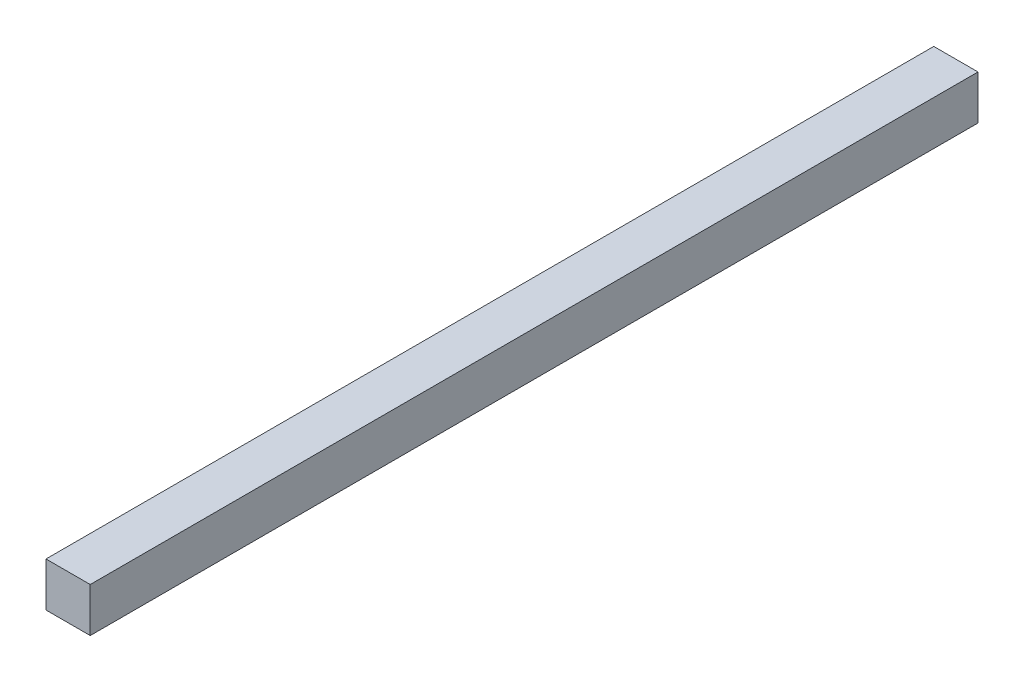
ISO-10303-21;
HEADER;
FILE_DESCRIPTION(('STEP AP214'),'2;1');
FILE_NAME('part.step','',(''),(''),'','','');
FILE_SCHEMA(('AUTOMOTIVE_DESIGN { 1 0 10303 214 1 1 1 1 }'));
ENDSEC;
DATA;
#1=APPLICATION_CONTEXT('core data for automotive mechanical design processes');
#2=APPLICATION_PROTOCOL_DEFINITION('international standard','automotive_design',2000,#1);
#3=PRODUCT_CONTEXT('',#1,'mechanical');
#4=PRODUCT('Part','Part','',(#3));
#5=PRODUCT_RELATED_PRODUCT_CATEGORY('part','',(#4));
#6=PRODUCT_DEFINITION_FORMATION('','',#4);
#7=PRODUCT_DEFINITION_CONTEXT('part definition',#1,'design');
#8=PRODUCT_DEFINITION('design','',#6,#7);
#9=PRODUCT_DEFINITION_SHAPE('','',#8);
#10=(LENGTH_UNIT() NAMED_UNIT(*) SI_UNIT(.MILLI.,.METRE.));
#11=(NAMED_UNIT(*) PLANE_ANGLE_UNIT() SI_UNIT($,.RADIAN.));
#12=(NAMED_UNIT(*) SI_UNIT($,.STERADIAN.) SOLID_ANGLE_UNIT());
#13=UNCERTAINTY_MEASURE_WITH_UNIT(LENGTH_MEASURE(1.E-05),#10,'distance_accuracy_value','');
#14=(GEOMETRIC_REPRESENTATION_CONTEXT(3) GLOBAL_UNCERTAINTY_ASSIGNED_CONTEXT((#13)) GLOBAL_UNIT_ASSIGNED_CONTEXT((#10,
#11,#12)) REPRESENTATION_CONTEXT('',''));
#15=CARTESIAN_POINT('',(0.,0.,0.));
#16=DIRECTION('',(0.,0.,1.));
#17=DIRECTION('',(1.,0.,0.));
#18=AXIS2_PLACEMENT_3D('',#15,#16,#17);
#19=CARTESIAN_POINT('',(-5.,5.,200.7));
#20=DIRECTION('',(1.,0.,0.));
#21=DIRECTION('',(0.,1.,0.));
#22=AXIS2_PLACEMENT_3D('',#19,#20,#21);
#23=PLANE('',#22);
#24=DIRECTION('',(0.,-1.,0.));
#25=VECTOR('',#24,1.);
#26=CARTESIAN_POINT('',(-5.,5.,0.));
#27=LINE('',#26,#25);
#28=CARTESIAN_POINT('',(-5.,5.,0.));
#29=VERTEX_POINT('',#28);
#30=CARTESIAN_POINT('',(-5.,-5.,0.));
#31=VERTEX_POINT('',#30);
#32=EDGE_CURVE('E95',#29,#31,#27,.T.);
#33=ORIENTED_EDGE('',*,*,#32,.T.);
#34=DIRECTION('',(0.,0.,-1.));
#35=VECTOR('',#34,1.);
#36=CARTESIAN_POINT('',(-5.,-5.,200.7));
#37=LINE('',#36,#35);
#38=CARTESIAN_POINT('',(-5.,-5.,200.7));
#39=VERTEX_POINT('',#38);
#40=EDGE_CURVE('E11',#39,#31,#37,.T.);
#41=ORIENTED_EDGE('',*,*,#40,.F.);
#42=DIRECTION('',(0.,-1.,0.));
#43=VECTOR('',#42,1.);
#44=CARTESIAN_POINT('',(-5.,5.,200.7));
#45=LINE('',#44,#43);
#46=CARTESIAN_POINT('',(-5.,5.,200.7));
#47=VERTEX_POINT('',#46);
#48=EDGE_CURVE('E83',#47,#39,#45,.T.);
#49=ORIENTED_EDGE('',*,*,#48,.F.);
#50=DIRECTION('',(0.,0.,-1.));
#51=VECTOR('',#50,1.);
#52=CARTESIAN_POINT('',(-5.,5.,200.7));
#53=LINE('',#52,#51);
#54=EDGE_CURVE('E91',#47,#29,#53,.T.);
#55=ORIENTED_EDGE('',*,*,#54,.T.);
#56=EDGE_LOOP('',(#33,#41,#49,#55));
#57=FACE_BOUND('',#56,.T.);
#58=ADVANCED_FACE('F32',(#57),#23,.F.);
#59=CARTESIAN_POINT('',(5.,-5.,200.7));
#60=DIRECTION('',(0.,1.,0.));
#61=DIRECTION('',(-1.,0.,0.));
#62=AXIS2_PLACEMENT_3D('',#59,#60,#61);
#63=PLANE('',#62);
#64=DIRECTION('',(1.,0.,0.));
#65=VECTOR('',#64,1.);
#66=CARTESIAN_POINT('',(5.,-5.,0.));
#67=LINE('',#66,#65);
#68=CARTESIAN_POINT('',(5.,-5.,0.));
#69=VERTEX_POINT('',#68);
#70=EDGE_CURVE('E87',#31,#69,#67,.T.);
#71=ORIENTED_EDGE('',*,*,#70,.T.);
#72=DIRECTION('',(0.,0.,-1.));
#73=VECTOR('',#72,1.);
#74=CARTESIAN_POINT('',(5.,-5.,200.7));
#75=LINE('',#74,#73);
#76=CARTESIAN_POINT('',(5.,-5.,200.7));
#77=VERTEX_POINT('',#76);
#78=EDGE_CURVE('E40',#77,#69,#75,.T.);
#79=ORIENTED_EDGE('',*,*,#78,.F.);
#80=DIRECTION('',(1.,0.,0.));
#81=VECTOR('',#80,1.);
#82=CARTESIAN_POINT('',(5.,-5.,200.7));
#83=LINE('',#82,#81);
#84=EDGE_CURVE('E78',#39,#77,#83,.T.);
#85=ORIENTED_EDGE('',*,*,#84,.F.);
#86=ORIENTED_EDGE('',*,*,#40,.T.);
#87=EDGE_LOOP('',(#71,#79,#85,#86));
#88=FACE_BOUND('',#87,.T.);
#89=ADVANCED_FACE('F86',(#88),#63,.F.);
#90=CARTESIAN_POINT('',(5.,5.,200.7));
#91=DIRECTION('',(-1.,0.,0.));
#92=DIRECTION('',(0.,-1.,0.));
#93=AXIS2_PLACEMENT_3D('',#90,#91,#92);
#94=PLANE('',#93);
#95=DIRECTION('',(0.,1.,0.));
#96=VECTOR('',#95,1.);
#97=CARTESIAN_POINT('',(5.,5.,0.));
#98=LINE('',#97,#96);
#99=CARTESIAN_POINT('',(5.,5.,0.));
#100=VERTEX_POINT('',#99);
#101=EDGE_CURVE('E65',#69,#100,#98,.T.);
#102=ORIENTED_EDGE('',*,*,#101,.T.);
#103=DIRECTION('',(0.,0.,-1.));
#104=VECTOR('',#103,1.);
#105=CARTESIAN_POINT('',(5.,5.,200.7));
#106=LINE('',#105,#104);
#107=CARTESIAN_POINT('',(5.,5.,200.7));
#108=VERTEX_POINT('',#107);
#109=EDGE_CURVE('E88',#108,#100,#106,.T.);
#110=ORIENTED_EDGE('',*,*,#109,.F.);
#111=DIRECTION('',(0.,1.,0.));
#112=VECTOR('',#111,1.);
#113=CARTESIAN_POINT('',(5.,5.,200.7));
#114=LINE('',#113,#112);
#115=EDGE_CURVE('E81',#77,#108,#114,.T.);
#116=ORIENTED_EDGE('',*,*,#115,.F.);
#117=ORIENTED_EDGE('',*,*,#78,.T.);
#118=EDGE_LOOP('',(#102,#110,#116,#117));
#119=FACE_BOUND('',#118,.T.);
#120=ADVANCED_FACE('F89',(#119),#94,.F.);
#121=CARTESIAN_POINT('',(5.,5.,200.7));
#122=DIRECTION('',(0.,-1.,0.));
#123=DIRECTION('',(1.,0.,0.));
#124=AXIS2_PLACEMENT_3D('',#121,#122,#123);
#125=PLANE('',#124);
#126=DIRECTION('',(-1.,0.,0.));
#127=VECTOR('',#126,1.);
#128=CARTESIAN_POINT('',(5.,5.,0.));
#129=LINE('',#128,#127);
#130=EDGE_CURVE('E71',#100,#29,#129,.T.);
#131=ORIENTED_EDGE('',*,*,#130,.T.);
#132=ORIENTED_EDGE('',*,*,#54,.F.);
#133=DIRECTION('',(-1.,0.,0.));
#134=VECTOR('',#133,1.);
#135=CARTESIAN_POINT('',(5.,5.,200.7));
#136=LINE('',#135,#134);
#137=EDGE_CURVE('E48',#108,#47,#136,.T.);
#138=ORIENTED_EDGE('',*,*,#137,.F.);
#139=ORIENTED_EDGE('',*,*,#109,.T.);
#140=EDGE_LOOP('',(#131,#132,#138,#139));
#141=FACE_BOUND('',#140,.T.);
#142=ADVANCED_FACE('F102',(#141),#125,.F.);
#143=CARTESIAN_POINT('',(0.,0.,200.7));
#144=DIRECTION('',(0.,0.,-1.));
#145=DIRECTION('',(-1.,0.,0.));
#146=AXIS2_PLACEMENT_3D('',#143,#144,#145);
#147=PLANE('',#146);
#148=ORIENTED_EDGE('',*,*,#48,.T.);
#149=ORIENTED_EDGE('',*,*,#84,.T.);
#150=ORIENTED_EDGE('',*,*,#115,.T.);
#151=ORIENTED_EDGE('',*,*,#137,.T.);
#152=EDGE_LOOP('',(#148,#149,#150,#151));
#153=FACE_BOUND('',#152,.T.);
#154=ADVANCED_FACE('F79',(#153),#147,.F.);
#155=CARTESIAN_POINT('',(0.,0.,0.));
#156=DIRECTION('',(0.,0.,-1.));
#157=DIRECTION('',(-1.,0.,0.));
#158=AXIS2_PLACEMENT_3D('',#155,#156,#157);
#159=PLANE('',#158);
#160=ORIENTED_EDGE('',*,*,#32,.F.);
#161=ORIENTED_EDGE('',*,*,#130,.F.);
#162=ORIENTED_EDGE('',*,*,#101,.F.);
#163=ORIENTED_EDGE('',*,*,#70,.F.);
#164=EDGE_LOOP('',(#160,#161,#162,#163));
#165=FACE_BOUND('',#164,.T.);
#166=ADVANCED_FACE('F105',(#165),#159,.T.);
#167=CLOSED_SHELL('',(#58,#89,#120,#142,#154,#166));
#168=MANIFOLD_SOLID_BREP('B2',#167);
#169=ADVANCED_BREP_SHAPE_REPRESENTATION('',(#18,#168),#14);
#170=SHAPE_DEFINITION_REPRESENTATION(#9,#169);
ENDSEC;
END-ISO-10303-21;
